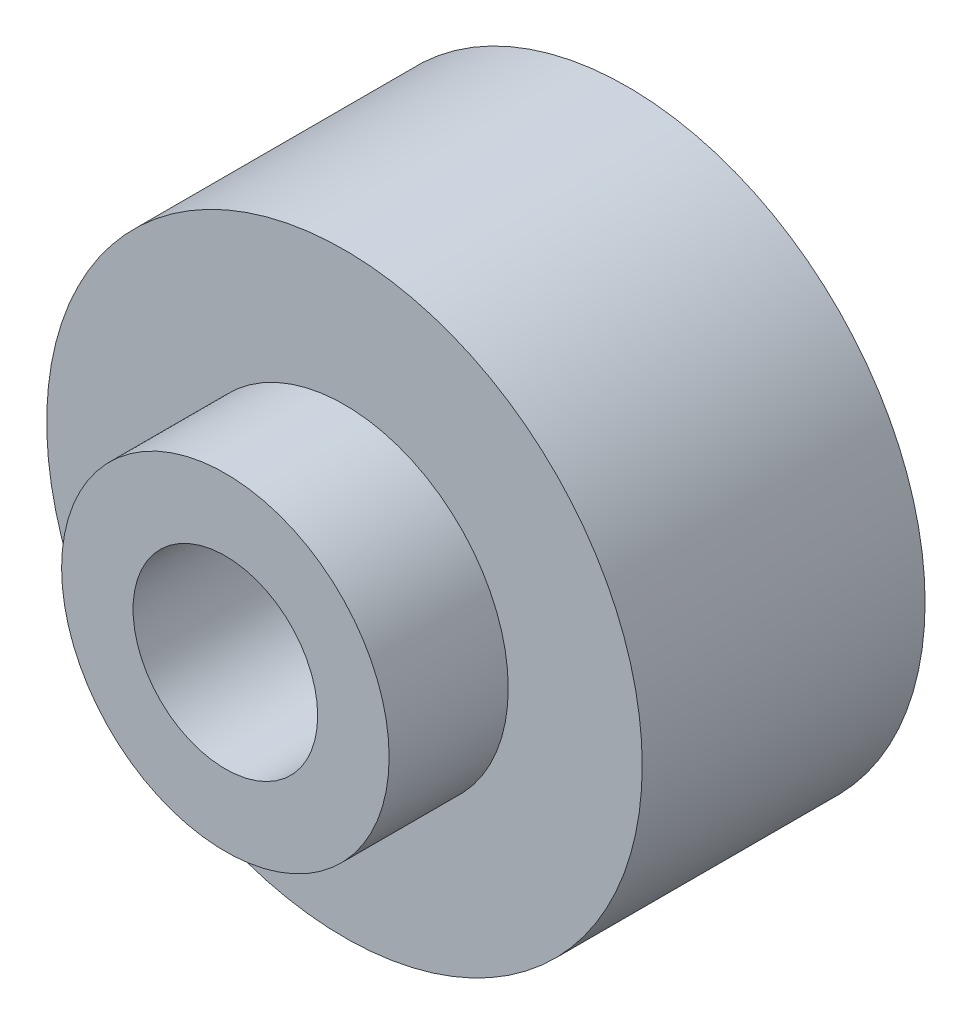
ISO-10303-21;
HEADER;
FILE_DESCRIPTION(('STEP AP214'),'2;1');
FILE_NAME('part.step','',(''),(''),'','','');
FILE_SCHEMA(('AUTOMOTIVE_DESIGN { 1 0 10303 214 1 1 1 1 }'));
ENDSEC;
DATA;
#1=APPLICATION_CONTEXT('core data for automotive mechanical design processes');
#2=APPLICATION_PROTOCOL_DEFINITION('international standard','automotive_design',2000,#1);
#3=PRODUCT_CONTEXT('',#1,'mechanical');
#4=PRODUCT('Part','Part','',(#3));
#5=PRODUCT_RELATED_PRODUCT_CATEGORY('part','',(#4));
#6=PRODUCT_DEFINITION_FORMATION('','',#4);
#7=PRODUCT_DEFINITION_CONTEXT('part definition',#1,'design');
#8=PRODUCT_DEFINITION('design','',#6,#7);
#9=PRODUCT_DEFINITION_SHAPE('','',#8);
#10=(LENGTH_UNIT() NAMED_UNIT(*) SI_UNIT(.MILLI.,.METRE.));
#11=(NAMED_UNIT(*) PLANE_ANGLE_UNIT() SI_UNIT($,.RADIAN.));
#12=(NAMED_UNIT(*) SI_UNIT($,.STERADIAN.) SOLID_ANGLE_UNIT());
#13=UNCERTAINTY_MEASURE_WITH_UNIT(LENGTH_MEASURE(1.E-05),#10,'distance_accuracy_value','');
#14=(GEOMETRIC_REPRESENTATION_CONTEXT(3) GLOBAL_UNCERTAINTY_ASSIGNED_CONTEXT((#13)) GLOBAL_UNIT_ASSIGNED_CONTEXT((#10,
#11,#12)) REPRESENTATION_CONTEXT('',''));
#15=CARTESIAN_POINT('',(0.,0.,0.));
#16=DIRECTION('',(0.,0.,1.));
#17=DIRECTION('',(1.,0.,0.));
#18=AXIS2_PLACEMENT_3D('',#15,#16,#17);
#19=CARTESIAN_POINT('',(0.,0.,4.75));
#20=DIRECTION('',(0.,0.,1.));
#21=DIRECTION('',(1.,0.,0.));
#22=AXIS2_PLACEMENT_3D('',#19,#20,#21);
#23=PLANE('',#22);
#24=CARTESIAN_POINT('',(0.,0.,4.75));
#25=DIRECTION('',(0.,0.,1.));
#26=DIRECTION('',(1.,0.,0.));
#27=AXIS2_PLACEMENT_3D('',#24,#25,#26);
#28=CIRCLE('',#27,5.);
#29=CARTESIAN_POINT('',(5.,0.,4.75));
#30=VERTEX_POINT('',#29);
#31=EDGE_CURVE('E10',#30,#30,#28,.T.);
#32=ORIENTED_EDGE('',*,*,#31,.T.);
#33=EDGE_LOOP('',(#32));
#34=FACE_BOUND('',#33,.T.);
#35=CARTESIAN_POINT('',(0.,0.,4.75));
#36=DIRECTION('',(0.,0.,1.));
#37=DIRECTION('',(1.,0.,0.));
#38=AXIS2_PLACEMENT_3D('',#35,#36,#37);
#39=CIRCLE('',#38,2.75);
#40=CARTESIAN_POINT('',(2.75,0.,4.75));
#41=VERTEX_POINT('',#40);
#42=EDGE_CURVE('E46',#41,#41,#39,.T.);
#43=ORIENTED_EDGE('',*,*,#42,.F.);
#44=EDGE_LOOP('',(#43));
#45=FACE_BOUND('',#44,.T.);
#46=ADVANCED_FACE('F33',(#34,#45),#23,.T.);
#47=CARTESIAN_POINT('',(0.,0.,0.));
#48=DIRECTION('',(0.,0.,1.));
#49=DIRECTION('',(1.,0.,0.));
#50=AXIS2_PLACEMENT_3D('',#47,#48,#49);
#51=PLANE('',#50);
#52=CARTESIAN_POINT('',(0.,0.,0.));
#53=DIRECTION('',(0.,0.,1.));
#54=DIRECTION('',(1.,0.,0.));
#55=AXIS2_PLACEMENT_3D('',#52,#53,#54);
#56=CIRCLE('',#55,3.);
#57=CARTESIAN_POINT('',(3.,0.,0.));
#58=VERTEX_POINT('',#57);
#59=EDGE_CURVE('E54',#58,#58,#56,.T.);
#60=ORIENTED_EDGE('',*,*,#59,.T.);
#61=EDGE_LOOP('',(#60));
#62=FACE_BOUND('',#61,.T.);
#63=CARTESIAN_POINT('',(0.,0.,0.));
#64=DIRECTION('',(0.,0.,1.));
#65=DIRECTION('',(1.,0.,0.));
#66=AXIS2_PLACEMENT_3D('',#63,#64,#65);
#67=CIRCLE('',#66,5.);
#68=CARTESIAN_POINT('',(5.,0.,0.));
#69=VERTEX_POINT('',#68);
#70=EDGE_CURVE('E37',#69,#69,#67,.T.);
#71=ORIENTED_EDGE('',*,*,#70,.F.);
#72=EDGE_LOOP('',(#71));
#73=FACE_BOUND('',#72,.T.);
#74=ADVANCED_FACE('F81',(#62,#73),#51,.F.);
#75=CARTESIAN_POINT('',(0.,0.,4.75));
#76=DIRECTION('',(0.,0.,-1.));
#77=DIRECTION('',(-1.,0.,0.));
#78=AXIS2_PLACEMENT_3D('',#75,#76,#77);
#79=CYLINDRICAL_SURFACE('',#78,5.);
#80=ORIENTED_EDGE('',*,*,#31,.F.);
#81=EDGE_LOOP('',(#80));
#82=FACE_BOUND('',#81,.T.);
#83=ORIENTED_EDGE('',*,*,#70,.T.);
#84=EDGE_LOOP('',(#83));
#85=FACE_BOUND('',#84,.T.);
#86=ADVANCED_FACE('F35',(#82,#85),#79,.T.);
#87=CARTESIAN_POINT('',(0.,0.,4.75));
#88=DIRECTION('',(0.,0.,-1.));
#89=DIRECTION('',(-1.,0.,0.));
#90=AXIS2_PLACEMENT_3D('',#87,#88,#89);
#91=CYLINDRICAL_SURFACE('',#90,1.55);
#92=CARTESIAN_POINT('',(0.,0.,2.));
#93=DIRECTION('',(0.,0.,1.));
#94=DIRECTION('',(1.,0.,0.));
#95=AXIS2_PLACEMENT_3D('',#92,#93,#94);
#96=CIRCLE('',#95,1.55);
#97=CARTESIAN_POINT('',(1.55,0.,2.));
#98=VERTEX_POINT('',#97);
#99=EDGE_CURVE('E57',#98,#98,#96,.T.);
#100=ORIENTED_EDGE('',*,*,#99,.F.);
#101=EDGE_LOOP('',(#100));
#102=FACE_BOUND('',#101,.T.);
#103=CARTESIAN_POINT('',(0.,0.,6.75));
#104=DIRECTION('',(0.,0.,1.));
#105=DIRECTION('',(1.,0.,0.));
#106=AXIS2_PLACEMENT_3D('',#103,#104,#105);
#107=CIRCLE('',#106,1.55);
#108=CARTESIAN_POINT('',(1.55,0.,6.75));
#109=VERTEX_POINT('',#108);
#110=EDGE_CURVE('E49',#109,#109,#107,.T.);
#111=ORIENTED_EDGE('',*,*,#110,.T.);
#112=EDGE_LOOP('',(#111));
#113=FACE_BOUND('',#112,.T.);
#114=ADVANCED_FACE('F63',(#102,#113),#91,.F.);
#115=CARTESIAN_POINT('',(0.,0.,6.75));
#116=DIRECTION('',(0.,0.,1.));
#117=DIRECTION('',(1.,0.,0.));
#118=AXIS2_PLACEMENT_3D('',#115,#116,#117);
#119=PLANE('',#118);
#120=CARTESIAN_POINT('',(0.,0.,6.75));
#121=DIRECTION('',(0.,0.,1.));
#122=DIRECTION('',(1.,0.,0.));
#123=AXIS2_PLACEMENT_3D('',#120,#121,#122);
#124=CIRCLE('',#123,2.75);
#125=CARTESIAN_POINT('',(2.75,0.,6.75));
#126=VERTEX_POINT('',#125);
#127=EDGE_CURVE('E44',#126,#126,#124,.T.);
#128=ORIENTED_EDGE('',*,*,#127,.T.);
#129=EDGE_LOOP('',(#128));
#130=FACE_BOUND('',#129,.T.);
#131=ORIENTED_EDGE('',*,*,#110,.F.);
#132=EDGE_LOOP('',(#131));
#133=FACE_BOUND('',#132,.T.);
#134=ADVANCED_FACE('F66',(#130,#133),#119,.T.);
#135=CARTESIAN_POINT('',(0.,0.,6.75));
#136=DIRECTION('',(0.,0.,-1.));
#137=DIRECTION('',(-1.,0.,0.));
#138=AXIS2_PLACEMENT_3D('',#135,#136,#137);
#139=CYLINDRICAL_SURFACE('',#138,2.75);
#140=ORIENTED_EDGE('',*,*,#127,.F.);
#141=EDGE_LOOP('',(#140));
#142=FACE_BOUND('',#141,.T.);
#143=ORIENTED_EDGE('',*,*,#42,.T.);
#144=EDGE_LOOP('',(#143));
#145=FACE_BOUND('',#144,.T.);
#146=ADVANCED_FACE('F71',(#142,#145),#139,.T.);
#147=CARTESIAN_POINT('',(0.,0.,2.));
#148=DIRECTION('',(0.,0.,-1.));
#149=DIRECTION('',(-1.,0.,0.));
#150=AXIS2_PLACEMENT_3D('',#147,#148,#149);
#151=CONICAL_SURFACE('',#150,1.55,0.627308192275763);
#152=ORIENTED_EDGE('',*,*,#59,.F.);
#153=EDGE_LOOP('',(#152));
#154=FACE_BOUND('',#153,.T.);
#155=ORIENTED_EDGE('',*,*,#99,.T.);
#156=EDGE_LOOP('',(#155));
#157=FACE_BOUND('',#156,.T.);
#158=ADVANCED_FACE('F61',(#154,#157),#151,.F.);
#159=CLOSED_SHELL('',(#46,#74,#86,#114,#134,#146,#158));
#160=MANIFOLD_SOLID_BREP('B2',#159);
#161=ADVANCED_BREP_SHAPE_REPRESENTATION('',(#18,#160),#14);
#162=SHAPE_DEFINITION_REPRESENTATION(#9,#161);
ENDSEC;
END-ISO-10303-21;
